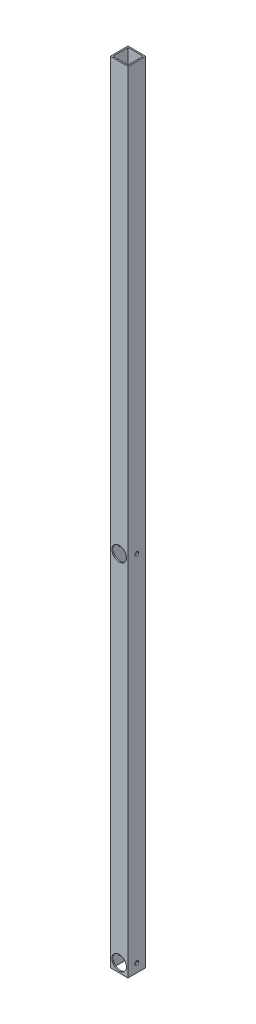
ISO-10303-21;
HEADER;
FILE_DESCRIPTION(('STEP AP214'),'2;1');
FILE_NAME('part.step','',(''),(''),'','','');
FILE_SCHEMA(('AUTOMOTIVE_DESIGN { 1 0 10303 214 1 1 1 1 }'));
ENDSEC;
DATA;
#1=APPLICATION_CONTEXT('core data for automotive mechanical design processes');
#2=APPLICATION_PROTOCOL_DEFINITION('international standard','automotive_design',2000,#1);
#3=PRODUCT_CONTEXT('',#1,'mechanical');
#4=PRODUCT('Part','Part','',(#3));
#5=PRODUCT_RELATED_PRODUCT_CATEGORY('part','',(#4));
#6=PRODUCT_DEFINITION_FORMATION('','',#4);
#7=PRODUCT_DEFINITION_CONTEXT('part definition',#1,'design');
#8=PRODUCT_DEFINITION('design','',#6,#7);
#9=PRODUCT_DEFINITION_SHAPE('','',#8);
#10=(LENGTH_UNIT() NAMED_UNIT(*) SI_UNIT(.MILLI.,.METRE.));
#11=(NAMED_UNIT(*) PLANE_ANGLE_UNIT() SI_UNIT($,.RADIAN.));
#12=(NAMED_UNIT(*) SI_UNIT($,.STERADIAN.) SOLID_ANGLE_UNIT());
#13=UNCERTAINTY_MEASURE_WITH_UNIT(LENGTH_MEASURE(1.E-05),#10,'distance_accuracy_value','');
#14=(GEOMETRIC_REPRESENTATION_CONTEXT(3) GLOBAL_UNCERTAINTY_ASSIGNED_CONTEXT((#13)) GLOBAL_UNIT_ASSIGNED_CONTEXT((#10,
#11,#12)) REPRESENTATION_CONTEXT('',''));
#15=CARTESIAN_POINT('',(0.,0.,0.));
#16=DIRECTION('',(0.,0.,1.));
#17=DIRECTION('',(1.,0.,0.));
#18=AXIS2_PLACEMENT_3D('',#15,#16,#17);
#19=CARTESIAN_POINT('',(0.,1981.2,0.));
#20=DIRECTION('',(0.,-1.,0.));
#21=DIRECTION('',(0.,0.,-1.));
#22=AXIS2_PLACEMENT_3D('',#19,#20,#21);
#23=PLANE('',#22);
#24=DIRECTION('',(0.,0.,1.));
#25=VECTOR('',#24,1.);
#26=CARTESIAN_POINT('',(0.,1981.2,0.));
#27=LINE('',#26,#25);
#28=CARTESIAN_POINT('',(0.,1981.2,-44.45));
#29=VERTEX_POINT('',#28);
#30=CARTESIAN_POINT('',(0.,1981.2,0.));
#31=VERTEX_POINT('',#30);
#32=EDGE_CURVE('E139',#29,#31,#27,.T.);
#33=ORIENTED_EDGE('',*,*,#32,.T.);
#34=DIRECTION('',(1.,0.,0.));
#35=VECTOR('',#34,1.);
#36=CARTESIAN_POINT('',(0.,1981.2,0.));
#37=LINE('',#36,#35);
#38=CARTESIAN_POINT('',(44.45,1981.2,0.));
#39=VERTEX_POINT('',#38);
#40=EDGE_CURVE('E142',#31,#39,#37,.T.);
#41=ORIENTED_EDGE('',*,*,#40,.T.);
#42=DIRECTION('',(0.,0.,-1.));
#43=VECTOR('',#42,1.);
#44=CARTESIAN_POINT('',(44.45,1981.2,0.));
#45=LINE('',#44,#43);
#46=CARTESIAN_POINT('',(44.45,1981.2,-44.45));
#47=VERTEX_POINT('',#46);
#48=EDGE_CURVE('E145',#39,#47,#45,.T.);
#49=ORIENTED_EDGE('',*,*,#48,.T.);
#50=DIRECTION('',(-1.,0.,0.));
#51=VECTOR('',#50,1.);
#52=CARTESIAN_POINT('',(0.,1981.2,-44.45));
#53=LINE('',#52,#51);
#54=EDGE_CURVE('E147',#47,#29,#53,.T.);
#55=ORIENTED_EDGE('',*,*,#54,.T.);
#56=EDGE_LOOP('',(#33,#41,#49,#55));
#57=FACE_BOUND('',#56,.T.);
#58=DIRECTION('',(1.,0.,0.));
#59=VECTOR('',#58,1.);
#60=CARTESIAN_POINT('',(3.175,1981.2,-3.175));
#61=LINE('',#60,#59);
#62=CARTESIAN_POINT('',(3.175,1981.2,-3.175));
#63=VERTEX_POINT('',#62);
#64=CARTESIAN_POINT('',(41.275,1981.2,-3.175));
#65=VERTEX_POINT('',#64);
#66=EDGE_CURVE('E101',#63,#65,#61,.T.);
#67=ORIENTED_EDGE('',*,*,#66,.F.);
#68=DIRECTION('',(0.,0.,1.));
#69=VECTOR('',#68,1.);
#70=CARTESIAN_POINT('',(3.175,1981.2,-3.175));
#71=LINE('',#70,#69);
#72=CARTESIAN_POINT('',(3.175,1981.2,-41.275));
#73=VERTEX_POINT('',#72);
#74=EDGE_CURVE('E123',#73,#63,#71,.T.);
#75=ORIENTED_EDGE('',*,*,#74,.F.);
#76=DIRECTION('',(-1.,0.,0.));
#77=VECTOR('',#76,1.);
#78=CARTESIAN_POINT('',(3.175,1981.2,-41.275));
#79=LINE('',#78,#77);
#80=CARTESIAN_POINT('',(41.275,1981.2,-41.275));
#81=VERTEX_POINT('',#80);
#82=EDGE_CURVE('E121',#81,#73,#79,.T.);
#83=ORIENTED_EDGE('',*,*,#82,.F.);
#84=DIRECTION('',(0.,0.,-1.));
#85=VECTOR('',#84,1.);
#86=CARTESIAN_POINT('',(41.275,1981.2,-3.175));
#87=LINE('',#86,#85);
#88=EDGE_CURVE('E109',#65,#81,#87,.T.);
#89=ORIENTED_EDGE('',*,*,#88,.F.);
#90=EDGE_LOOP('',(#67,#75,#83,#89));
#91=FACE_BOUND('',#90,.T.);
#92=ADVANCED_FACE('F34',(#57,#91),#23,.F.);
#93=CARTESIAN_POINT('',(0.,0.,0.));
#94=DIRECTION('',(0.,-1.,0.));
#95=DIRECTION('',(0.,0.,-1.));
#96=AXIS2_PLACEMENT_3D('',#93,#94,#95);
#97=PLANE('',#96);
#98=DIRECTION('',(0.,0.,1.));
#99=VECTOR('',#98,1.);
#100=CARTESIAN_POINT('',(0.,0.,0.));
#101=LINE('',#100,#99);
#102=CARTESIAN_POINT('',(0.,0.,-44.45));
#103=VERTEX_POINT('',#102);
#104=CARTESIAN_POINT('',(0.,0.,0.));
#105=VERTEX_POINT('',#104);
#106=EDGE_CURVE('E117',#103,#105,#101,.T.);
#107=ORIENTED_EDGE('',*,*,#106,.F.);
#108=DIRECTION('',(-1.,0.,0.));
#109=VECTOR('',#108,1.);
#110=CARTESIAN_POINT('',(0.,0.,-44.45));
#111=LINE('',#110,#109);
#112=CARTESIAN_POINT('',(44.45,0.,-44.45));
#113=VERTEX_POINT('',#112);
#114=EDGE_CURVE('E143',#113,#103,#111,.T.);
#115=ORIENTED_EDGE('',*,*,#114,.F.);
#116=DIRECTION('',(0.,0.,-1.));
#117=VECTOR('',#116,1.);
#118=CARTESIAN_POINT('',(44.45,0.,0.));
#119=LINE('',#118,#117);
#120=CARTESIAN_POINT('',(44.45,0.,0.));
#121=VERTEX_POINT('',#120);
#122=EDGE_CURVE('E154',#121,#113,#119,.T.);
#123=ORIENTED_EDGE('',*,*,#122,.F.);
#124=DIRECTION('',(1.,0.,0.));
#125=VECTOR('',#124,1.);
#126=CARTESIAN_POINT('',(0.,0.,0.));
#127=LINE('',#126,#125);
#128=EDGE_CURVE('E152',#105,#121,#127,.T.);
#129=ORIENTED_EDGE('',*,*,#128,.F.);
#130=EDGE_LOOP('',(#107,#115,#123,#129));
#131=FACE_BOUND('',#130,.T.);
#132=DIRECTION('',(0.,0.,1.));
#133=VECTOR('',#132,1.);
#134=CARTESIAN_POINT('',(3.175,0.,-3.175));
#135=LINE('',#134,#133);
#136=CARTESIAN_POINT('',(3.175,0.,-41.275));
#137=VERTEX_POINT('',#136);
#138=CARTESIAN_POINT('',(3.175,0.,-3.175));
#139=VERTEX_POINT('',#138);
#140=EDGE_CURVE('E110',#137,#139,#135,.T.);
#141=ORIENTED_EDGE('',*,*,#140,.T.);
#142=DIRECTION('',(1.,0.,0.));
#143=VECTOR('',#142,1.);
#144=CARTESIAN_POINT('',(3.175,0.,-3.175));
#145=LINE('',#144,#143);
#146=CARTESIAN_POINT('',(41.275,0.,-3.175));
#147=VERTEX_POINT('',#146);
#148=EDGE_CURVE('E59',#139,#147,#145,.T.);
#149=ORIENTED_EDGE('',*,*,#148,.T.);
#150=DIRECTION('',(0.,0.,-1.));
#151=VECTOR('',#150,1.);
#152=CARTESIAN_POINT('',(41.275,0.,-3.175));
#153=LINE('',#152,#151);
#154=CARTESIAN_POINT('',(41.275,0.,-41.275));
#155=VERTEX_POINT('',#154);
#156=EDGE_CURVE('E116',#147,#155,#153,.T.);
#157=ORIENTED_EDGE('',*,*,#156,.T.);
#158=DIRECTION('',(-1.,0.,0.));
#159=VECTOR('',#158,1.);
#160=CARTESIAN_POINT('',(3.175,0.,-41.275));
#161=LINE('',#160,#159);
#162=EDGE_CURVE('E131',#155,#137,#161,.T.);
#163=ORIENTED_EDGE('',*,*,#162,.T.);
#164=EDGE_LOOP('',(#141,#149,#157,#163));
#165=FACE_BOUND('',#164,.T.);
#166=ADVANCED_FACE('F242',(#131,#165),#97,.T.);
#167=CARTESIAN_POINT('',(0.,1981.2,0.));
#168=DIRECTION('',(1.,0.,0.));
#169=DIRECTION('',(0.,0.,-1.));
#170=AXIS2_PLACEMENT_3D('',#167,#168,#169);
#171=PLANE('',#170);
#172=CARTESIAN_POINT('',(0.,22.2249999999999,-22.225));
#173=DIRECTION('',(1.,0.,0.));
#174=DIRECTION('',(0.,0.,-1.));
#175=AXIS2_PLACEMENT_3D('',#172,#173,#174);
#176=CIRCLE('',#175,4.7625);
#177=CARTESIAN_POINT('',(0.,22.2249999999999,-26.9875));
#178=VERTEX_POINT('',#177);
#179=EDGE_CURVE('E174',#178,#178,#176,.T.);
#180=ORIENTED_EDGE('',*,*,#179,.T.);
#181=EDGE_LOOP('',(#180));
#182=FACE_BOUND('',#181,.T.);
#183=CARTESIAN_POINT('',(0.,911.225,-22.225));
#184=DIRECTION('',(1.,0.,0.));
#185=DIRECTION('',(0.,0.,-1.));
#186=AXIS2_PLACEMENT_3D('',#183,#184,#185);
#187=CIRCLE('',#186,4.76250000000002);
#188=CARTESIAN_POINT('',(0.,911.225,-26.9875));
#189=VERTEX_POINT('',#188);
#190=EDGE_CURVE('E185',#189,#189,#187,.T.);
#191=ORIENTED_EDGE('',*,*,#190,.T.);
#192=EDGE_LOOP('',(#191));
#193=FACE_BOUND('',#192,.T.);
#194=ORIENTED_EDGE('',*,*,#106,.T.);
#195=DIRECTION('',(0.,-1.,0.));
#196=VECTOR('',#195,1.);
#197=CARTESIAN_POINT('',(0.,1981.2,0.));
#198=LINE('',#197,#196);
#199=EDGE_CURVE('E11',#31,#105,#198,.T.);
#200=ORIENTED_EDGE('',*,*,#199,.F.);
#201=ORIENTED_EDGE('',*,*,#32,.F.);
#202=DIRECTION('',(0.,-1.,0.));
#203=VECTOR('',#202,1.);
#204=CARTESIAN_POINT('',(0.,1981.2,-44.45));
#205=LINE('',#204,#203);
#206=EDGE_CURVE('E149',#29,#103,#205,.T.);
#207=ORIENTED_EDGE('',*,*,#206,.T.);
#208=EDGE_LOOP('',(#194,#200,#201,#207));
#209=FACE_BOUND('',#208,.T.);
#210=ADVANCED_FACE('F36',(#182,#193,#209),#171,.F.);
#211=CARTESIAN_POINT('',(0.,1981.2,0.));
#212=DIRECTION('',(0.,0.,-1.));
#213=DIRECTION('',(-1.,0.,0.));
#214=AXIS2_PLACEMENT_3D('',#211,#212,#213);
#215=PLANE('',#214);
#216=CARTESIAN_POINT('',(22.225,22.2249999999999,0.));
#217=DIRECTION('',(0.,0.,1.));
#218=DIRECTION('',(1.,0.,0.));
#219=AXIS2_PLACEMENT_3D('',#216,#217,#218);
#220=CIRCLE('',#219,18.25625);
#221=CARTESIAN_POINT('',(40.48125,22.2249999999999,0.));
#222=VERTEX_POINT('',#221);
#223=EDGE_CURVE('E199',#222,#222,#220,.T.);
#224=ORIENTED_EDGE('',*,*,#223,.F.);
#225=EDGE_LOOP('',(#224));
#226=FACE_BOUND('',#225,.T.);
#227=CARTESIAN_POINT('',(22.225,911.225,0.));
#228=DIRECTION('',(0.,0.,1.));
#229=DIRECTION('',(1.,0.,0.));
#230=AXIS2_PLACEMENT_3D('',#227,#228,#229);
#231=CIRCLE('',#230,18.25625);
#232=CARTESIAN_POINT('',(40.48125,911.225,0.));
#233=VERTEX_POINT('',#232);
#234=EDGE_CURVE('E196',#233,#233,#231,.T.);
#235=ORIENTED_EDGE('',*,*,#234,.F.);
#236=EDGE_LOOP('',(#235));
#237=FACE_BOUND('',#236,.T.);
#238=ORIENTED_EDGE('',*,*,#128,.T.);
#239=DIRECTION('',(0.,-1.,0.));
#240=VECTOR('',#239,1.);
#241=CARTESIAN_POINT('',(44.45,1981.2,0.));
#242=LINE('',#241,#240);
#243=EDGE_CURVE('E43',#39,#121,#242,.T.);
#244=ORIENTED_EDGE('',*,*,#243,.F.);
#245=ORIENTED_EDGE('',*,*,#40,.F.);
#246=ORIENTED_EDGE('',*,*,#199,.T.);
#247=EDGE_LOOP('',(#238,#244,#245,#246));
#248=FACE_BOUND('',#247,.T.);
#249=ADVANCED_FACE('F228',(#226,#237,#248),#215,.F.);
#250=CARTESIAN_POINT('',(44.45,1981.2,0.));
#251=DIRECTION('',(-1.,0.,0.));
#252=DIRECTION('',(0.,0.,1.));
#253=AXIS2_PLACEMENT_3D('',#250,#251,#252);
#254=PLANE('',#253);
#255=CARTESIAN_POINT('',(44.45,22.2249999999999,-22.225));
#256=DIRECTION('',(1.,0.,0.));
#257=DIRECTION('',(0.,0.,-1.));
#258=AXIS2_PLACEMENT_3D('',#255,#256,#257);
#259=CIRCLE('',#258,4.7625);
#260=CARTESIAN_POINT('',(44.45,22.2249999999999,-26.9875));
#261=VERTEX_POINT('',#260);
#262=EDGE_CURVE('E180',#261,#261,#259,.T.);
#263=ORIENTED_EDGE('',*,*,#262,.F.);
#264=EDGE_LOOP('',(#263));
#265=FACE_BOUND('',#264,.T.);
#266=CARTESIAN_POINT('',(44.45,911.225,-22.225));
#267=DIRECTION('',(1.,0.,0.));
#268=DIRECTION('',(0.,0.,-1.));
#269=AXIS2_PLACEMENT_3D('',#266,#267,#268);
#270=CIRCLE('',#269,4.76250000000002);
#271=CARTESIAN_POINT('',(44.45,911.225,-26.9875));
#272=VERTEX_POINT('',#271);
#273=EDGE_CURVE('E190',#272,#272,#270,.T.);
#274=ORIENTED_EDGE('',*,*,#273,.F.);
#275=EDGE_LOOP('',(#274));
#276=FACE_BOUND('',#275,.T.);
#277=ORIENTED_EDGE('',*,*,#122,.T.);
#278=DIRECTION('',(0.,-1.,0.));
#279=VECTOR('',#278,1.);
#280=CARTESIAN_POINT('',(44.45,1981.2,-44.45));
#281=LINE('',#280,#279);
#282=EDGE_CURVE('E159',#47,#113,#281,.T.);
#283=ORIENTED_EDGE('',*,*,#282,.F.);
#284=ORIENTED_EDGE('',*,*,#48,.F.);
#285=ORIENTED_EDGE('',*,*,#243,.T.);
#286=EDGE_LOOP('',(#277,#283,#284,#285));
#287=FACE_BOUND('',#286,.T.);
#288=ADVANCED_FACE('F231',(#265,#276,#287),#254,.F.);
#289=CARTESIAN_POINT('',(0.,1981.2,-44.45));
#290=DIRECTION('',(0.,0.,1.));
#291=DIRECTION('',(1.,0.,0.));
#292=AXIS2_PLACEMENT_3D('',#289,#290,#291);
#293=PLANE('',#292);
#294=CARTESIAN_POINT('',(22.225,22.2249999999999,-44.45));
#295=DIRECTION('',(0.,0.,1.));
#296=DIRECTION('',(1.,0.,0.));
#297=AXIS2_PLACEMENT_3D('',#294,#295,#296);
#298=CIRCLE('',#297,18.25625);
#299=CARTESIAN_POINT('',(40.48125,22.2249999999999,-44.45));
#300=VERTEX_POINT('',#299);
#301=EDGE_CURVE('E168',#300,#300,#298,.T.);
#302=ORIENTED_EDGE('',*,*,#301,.T.);
#303=EDGE_LOOP('',(#302));
#304=FACE_BOUND('',#303,.T.);
#305=CARTESIAN_POINT('',(22.225,911.225,-44.45));
#306=DIRECTION('',(0.,0.,1.));
#307=DIRECTION('',(1.,0.,0.));
#308=AXIS2_PLACEMENT_3D('',#305,#306,#307);
#309=CIRCLE('',#308,18.25625);
#310=CARTESIAN_POINT('',(40.48125,911.225,-44.45));
#311=VERTEX_POINT('',#310);
#312=EDGE_CURVE('E202',#311,#311,#309,.T.);
#313=ORIENTED_EDGE('',*,*,#312,.T.);
#314=EDGE_LOOP('',(#313));
#315=FACE_BOUND('',#314,.T.);
#316=ORIENTED_EDGE('',*,*,#114,.T.);
#317=ORIENTED_EDGE('',*,*,#206,.F.);
#318=ORIENTED_EDGE('',*,*,#54,.F.);
#319=ORIENTED_EDGE('',*,*,#282,.T.);
#320=EDGE_LOOP('',(#316,#317,#318,#319));
#321=FACE_BOUND('',#320,.T.);
#322=ADVANCED_FACE('F216',(#304,#315,#321),#293,.F.);
#323=CARTESIAN_POINT('',(3.175,1981.2,-3.175));
#324=DIRECTION('',(0.,0.,-1.));
#325=DIRECTION('',(-1.,0.,0.));
#326=AXIS2_PLACEMENT_3D('',#323,#324,#325);
#327=PLANE('',#326);
#328=CARTESIAN_POINT('',(22.225,22.2249999999999,-3.175));
#329=DIRECTION('',(0.,0.,-1.));
#330=DIRECTION('',(-1.,0.,0.));
#331=AXIS2_PLACEMENT_3D('',#328,#329,#330);
#332=CIRCLE('',#331,18.25625);
#333=CARTESIAN_POINT('',(3.96875,22.2249999999999,-3.175));
#334=VERTEX_POINT('',#333);
#335=EDGE_CURVE('E129',#334,#334,#332,.T.);
#336=ORIENTED_EDGE('',*,*,#335,.F.);
#337=EDGE_LOOP('',(#336));
#338=FACE_BOUND('',#337,.T.);
#339=CARTESIAN_POINT('',(22.225,911.225,-3.175));
#340=DIRECTION('',(0.,0.,-1.));
#341=DIRECTION('',(-1.,0.,0.));
#342=AXIS2_PLACEMENT_3D('',#339,#340,#341);
#343=CIRCLE('',#342,18.25625);
#344=CARTESIAN_POINT('',(3.96874999999999,911.225,-3.175));
#345=VERTEX_POINT('',#344);
#346=EDGE_CURVE('E167',#345,#345,#343,.T.);
#347=ORIENTED_EDGE('',*,*,#346,.F.);
#348=EDGE_LOOP('',(#347));
#349=FACE_BOUND('',#348,.T.);
#350=ORIENTED_EDGE('',*,*,#148,.F.);
#351=DIRECTION('',(0.,-1.,0.));
#352=VECTOR('',#351,1.);
#353=CARTESIAN_POINT('',(3.175,1981.2,-3.175));
#354=LINE('',#353,#352);
#355=EDGE_CURVE('E105',#63,#139,#354,.T.);
#356=ORIENTED_EDGE('',*,*,#355,.F.);
#357=ORIENTED_EDGE('',*,*,#66,.T.);
#358=DIRECTION('',(0.,-1.,0.));
#359=VECTOR('',#358,1.);
#360=CARTESIAN_POINT('',(41.275,1981.2,-3.175));
#361=LINE('',#360,#359);
#362=EDGE_CURVE('E104',#65,#147,#361,.T.);
#363=ORIENTED_EDGE('',*,*,#362,.T.);
#364=EDGE_LOOP('',(#350,#356,#357,#363));
#365=FACE_BOUND('',#364,.T.);
#366=ADVANCED_FACE('F103',(#338,#349,#365),#327,.T.);
#367=CARTESIAN_POINT('',(41.275,1981.2,-3.175));
#368=DIRECTION('',(-1.,0.,0.));
#369=DIRECTION('',(0.,0.,1.));
#370=AXIS2_PLACEMENT_3D('',#367,#368,#369);
#371=PLANE('',#370);
#372=CARTESIAN_POINT('',(41.275,22.2249999999999,-22.225));
#373=DIRECTION('',(-1.,0.,0.));
#374=DIRECTION('',(0.,0.,1.));
#375=AXIS2_PLACEMENT_3D('',#372,#373,#374);
#376=CIRCLE('',#375,4.7625);
#377=CARTESIAN_POINT('',(41.275,22.2249999999999,-17.4625));
#378=VERTEX_POINT('',#377);
#379=EDGE_CURVE('E193',#378,#378,#376,.T.);
#380=ORIENTED_EDGE('',*,*,#379,.F.);
#381=EDGE_LOOP('',(#380));
#382=FACE_BOUND('',#381,.T.);
#383=CARTESIAN_POINT('',(41.275,911.225,-22.225));
#384=DIRECTION('',(-1.,0.,0.));
#385=DIRECTION('',(0.,0.,1.));
#386=AXIS2_PLACEMENT_3D('',#383,#384,#385);
#387=CIRCLE('',#386,4.76250000000002);
#388=CARTESIAN_POINT('',(41.275,911.225,-17.4625));
#389=VERTEX_POINT('',#388);
#390=EDGE_CURVE('E173',#389,#389,#387,.T.);
#391=ORIENTED_EDGE('',*,*,#390,.F.);
#392=EDGE_LOOP('',(#391));
#393=FACE_BOUND('',#392,.T.);
#394=ORIENTED_EDGE('',*,*,#156,.F.);
#395=ORIENTED_EDGE('',*,*,#362,.F.);
#396=ORIENTED_EDGE('',*,*,#88,.T.);
#397=DIRECTION('',(0.,-1.,0.));
#398=VECTOR('',#397,1.);
#399=CARTESIAN_POINT('',(41.275,1981.2,-41.275));
#400=LINE('',#399,#398);
#401=EDGE_CURVE('E118',#81,#155,#400,.T.);
#402=ORIENTED_EDGE('',*,*,#401,.T.);
#403=EDGE_LOOP('',(#394,#395,#396,#402));
#404=FACE_BOUND('',#403,.T.);
#405=ADVANCED_FACE('F113',(#382,#393,#404),#371,.T.);
#406=CARTESIAN_POINT('',(3.175,1981.2,-41.275));
#407=DIRECTION('',(0.,0.,1.));
#408=DIRECTION('',(1.,0.,0.));
#409=AXIS2_PLACEMENT_3D('',#406,#407,#408);
#410=PLANE('',#409);
#411=CARTESIAN_POINT('',(22.225,22.2249999999999,-41.275));
#412=DIRECTION('',(0.,0.,1.));
#413=DIRECTION('',(1.,0.,0.));
#414=AXIS2_PLACEMENT_3D('',#411,#412,#413);
#415=CIRCLE('',#414,18.25625);
#416=CARTESIAN_POINT('',(40.48125,22.2249999999999,-41.275));
#417=VERTEX_POINT('',#416);
#418=EDGE_CURVE('E169',#417,#417,#415,.T.);
#419=ORIENTED_EDGE('',*,*,#418,.F.);
#420=EDGE_LOOP('',(#419));
#421=FACE_BOUND('',#420,.T.);
#422=CARTESIAN_POINT('',(22.225,911.225,-41.275));
#423=DIRECTION('',(0.,0.,1.));
#424=DIRECTION('',(1.,0.,0.));
#425=AXIS2_PLACEMENT_3D('',#422,#423,#424);
#426=CIRCLE('',#425,18.25625);
#427=CARTESIAN_POINT('',(40.48125,911.225,-41.275));
#428=VERTEX_POINT('',#427);
#429=EDGE_CURVE('E164',#428,#428,#426,.T.);
#430=ORIENTED_EDGE('',*,*,#429,.F.);
#431=EDGE_LOOP('',(#430));
#432=FACE_BOUND('',#431,.T.);
#433=ORIENTED_EDGE('',*,*,#162,.F.);
#434=ORIENTED_EDGE('',*,*,#401,.F.);
#435=ORIENTED_EDGE('',*,*,#82,.T.);
#436=DIRECTION('',(0.,-1.,0.));
#437=VECTOR('',#436,1.);
#438=CARTESIAN_POINT('',(3.175,1981.2,-41.275));
#439=LINE('',#438,#437);
#440=EDGE_CURVE('E51',#73,#137,#439,.T.);
#441=ORIENTED_EDGE('',*,*,#440,.T.);
#442=EDGE_LOOP('',(#433,#434,#435,#441));
#443=FACE_BOUND('',#442,.T.);
#444=ADVANCED_FACE('F325',(#421,#432,#443),#410,.T.);
#445=CARTESIAN_POINT('',(3.175,1981.2,-3.175));
#446=DIRECTION('',(1.,0.,0.));
#447=DIRECTION('',(0.,0.,-1.));
#448=AXIS2_PLACEMENT_3D('',#445,#446,#447);
#449=PLANE('',#448);
#450=CARTESIAN_POINT('',(3.175,22.2249999999999,-22.225));
#451=DIRECTION('',(1.,0.,0.));
#452=DIRECTION('',(0.,0.,-1.));
#453=AXIS2_PLACEMENT_3D('',#450,#451,#452);
#454=CIRCLE('',#453,4.7625);
#455=CARTESIAN_POINT('',(3.175,22.2249999999999,-26.9875));
#456=VERTEX_POINT('',#455);
#457=EDGE_CURVE('E38',#456,#456,#454,.T.);
#458=ORIENTED_EDGE('',*,*,#457,.F.);
#459=EDGE_LOOP('',(#458));
#460=FACE_BOUND('',#459,.T.);
#461=CARTESIAN_POINT('',(3.175,911.225,-22.225));
#462=DIRECTION('',(1.,0.,0.));
#463=DIRECTION('',(0.,0.,-1.));
#464=AXIS2_PLACEMENT_3D('',#461,#462,#463);
#465=CIRCLE('',#464,4.76250000000002);
#466=CARTESIAN_POINT('',(3.175,911.225,-26.9875));
#467=VERTEX_POINT('',#466);
#468=EDGE_CURVE('E171',#467,#467,#465,.T.);
#469=ORIENTED_EDGE('',*,*,#468,.F.);
#470=EDGE_LOOP('',(#469));
#471=FACE_BOUND('',#470,.T.);
#472=ORIENTED_EDGE('',*,*,#140,.F.);
#473=ORIENTED_EDGE('',*,*,#440,.F.);
#474=ORIENTED_EDGE('',*,*,#74,.T.);
#475=ORIENTED_EDGE('',*,*,#355,.T.);
#476=EDGE_LOOP('',(#472,#473,#474,#475));
#477=FACE_BOUND('',#476,.T.);
#478=ADVANCED_FACE('F334',(#460,#471,#477),#449,.T.);
#479=CARTESIAN_POINT('',(22.225,911.225,-44.45));
#480=DIRECTION('',(0.,0.,1.));
#481=DIRECTION('',(1.,0.,0.));
#482=AXIS2_PLACEMENT_3D('',#479,#480,#481);
#483=CYLINDRICAL_SURFACE('',#482,18.25625);
#484=ORIENTED_EDGE('',*,*,#429,.T.);
#485=EDGE_LOOP('',(#484));
#486=FACE_BOUND('',#485,.T.);
#487=ORIENTED_EDGE('',*,*,#312,.F.);
#488=EDGE_LOOP('',(#487));
#489=FACE_BOUND('',#488,.T.);
#490=ADVANCED_FACE('F225',(#486,#489),#483,.F.);
#491=CARTESIAN_POINT('',(22.225,22.2249999999999,-44.45));
#492=DIRECTION('',(0.,0.,1.));
#493=DIRECTION('',(1.,0.,0.));
#494=AXIS2_PLACEMENT_3D('',#491,#492,#493);
#495=CYLINDRICAL_SURFACE('',#494,18.25625);
#496=ORIENTED_EDGE('',*,*,#418,.T.);
#497=EDGE_LOOP('',(#496));
#498=FACE_BOUND('',#497,.T.);
#499=ORIENTED_EDGE('',*,*,#301,.F.);
#500=EDGE_LOOP('',(#499));
#501=FACE_BOUND('',#500,.T.);
#502=ADVANCED_FACE('F223',(#498,#501),#495,.F.);
#503=ORIENTED_EDGE('',*,*,#346,.T.);
#504=EDGE_LOOP('',(#503));
#505=FACE_BOUND('',#504,.T.);
#506=ORIENTED_EDGE('',*,*,#234,.T.);
#507=EDGE_LOOP('',(#506));
#508=FACE_BOUND('',#507,.T.);
#509=ADVANCED_FACE('F220',(#505,#508),#483,.F.);
#510=ORIENTED_EDGE('',*,*,#335,.T.);
#511=EDGE_LOOP('',(#510));
#512=FACE_BOUND('',#511,.T.);
#513=ORIENTED_EDGE('',*,*,#223,.T.);
#514=EDGE_LOOP('',(#513));
#515=FACE_BOUND('',#514,.T.);
#516=ADVANCED_FACE('F211',(#512,#515),#495,.F.);
#517=CARTESIAN_POINT('',(0.,911.225,-22.225));
#518=DIRECTION('',(1.,0.,0.));
#519=DIRECTION('',(0.,0.,-1.));
#520=AXIS2_PLACEMENT_3D('',#517,#518,#519);
#521=CYLINDRICAL_SURFACE('',#520,4.76250000000002);
#522=ORIENTED_EDGE('',*,*,#468,.T.);
#523=EDGE_LOOP('',(#522));
#524=FACE_BOUND('',#523,.T.);
#525=ORIENTED_EDGE('',*,*,#190,.F.);
#526=EDGE_LOOP('',(#525));
#527=FACE_BOUND('',#526,.T.);
#528=ADVANCED_FACE('F275',(#524,#527),#521,.F.);
#529=CARTESIAN_POINT('',(0.,22.2249999999999,-22.225));
#530=DIRECTION('',(1.,0.,0.));
#531=DIRECTION('',(0.,0.,-1.));
#532=AXIS2_PLACEMENT_3D('',#529,#530,#531);
#533=CYLINDRICAL_SURFACE('',#532,4.7625);
#534=ORIENTED_EDGE('',*,*,#457,.T.);
#535=EDGE_LOOP('',(#534));
#536=FACE_BOUND('',#535,.T.);
#537=ORIENTED_EDGE('',*,*,#179,.F.);
#538=EDGE_LOOP('',(#537));
#539=FACE_BOUND('',#538,.T.);
#540=ADVANCED_FACE('F272',(#536,#539),#533,.F.);
#541=ORIENTED_EDGE('',*,*,#390,.T.);
#542=EDGE_LOOP('',(#541));
#543=FACE_BOUND('',#542,.T.);
#544=ORIENTED_EDGE('',*,*,#273,.T.);
#545=EDGE_LOOP('',(#544));
#546=FACE_BOUND('',#545,.T.);
#547=ADVANCED_FACE('F269',(#543,#546),#521,.F.);
#548=ORIENTED_EDGE('',*,*,#379,.T.);
#549=EDGE_LOOP('',(#548));
#550=FACE_BOUND('',#549,.T.);
#551=ORIENTED_EDGE('',*,*,#262,.T.);
#552=EDGE_LOOP('',(#551));
#553=FACE_BOUND('',#552,.T.);
#554=ADVANCED_FACE('F271',(#550,#553),#533,.F.);
#555=CLOSED_SHELL('',(#92,#166,#210,#249,#288,#322,#366,#405,#444,#478,#490,#502,#509,#516,#528,
#540,#547,#554));
#556=MANIFOLD_SOLID_BREP('B2',#555);
#557=ADVANCED_BREP_SHAPE_REPRESENTATION('',(#18,#556),#14);
#558=SHAPE_DEFINITION_REPRESENTATION(#9,#557);
ENDSEC;
END-ISO-10303-21;
